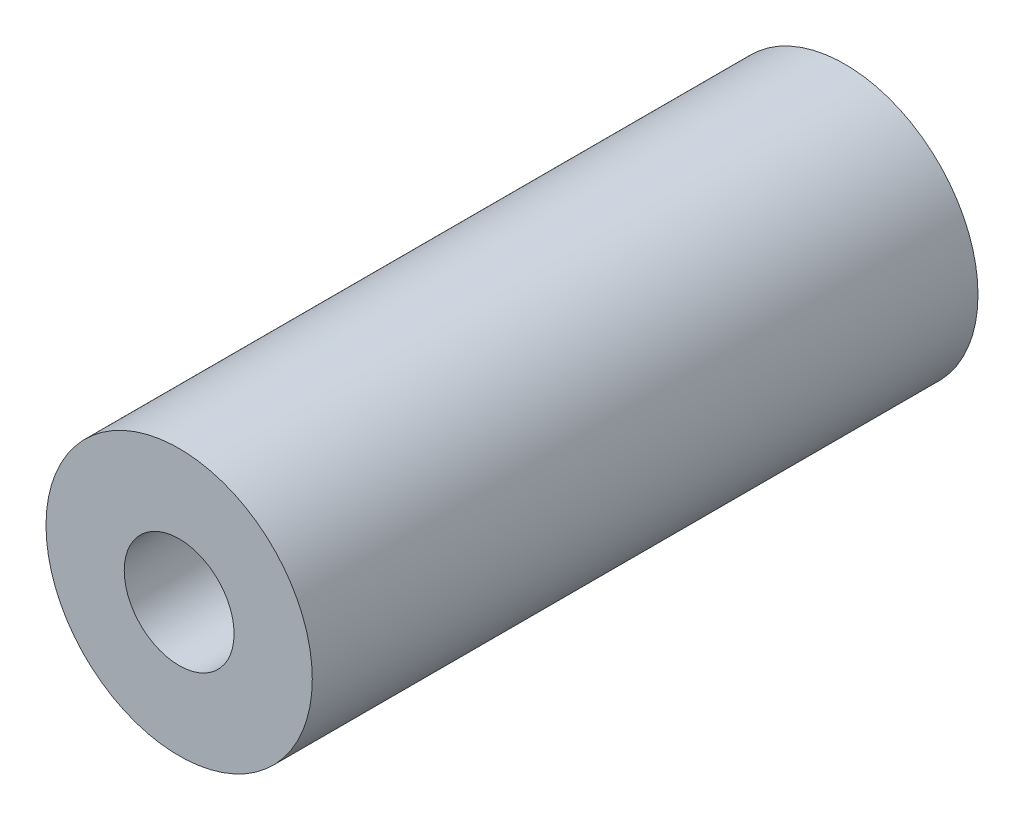
ISO-10303-21;
HEADER;
FILE_DESCRIPTION(('STEP AP214'),'2;1');
FILE_NAME('part.step','',(''),(''),'','','');
FILE_SCHEMA(('AUTOMOTIVE_DESIGN { 1 0 10303 214 1 1 1 1 }'));
ENDSEC;
DATA;
#1=APPLICATION_CONTEXT('core data for automotive mechanical design processes');
#2=APPLICATION_PROTOCOL_DEFINITION('international standard','automotive_design',2000,#1);
#3=PRODUCT_CONTEXT('',#1,'mechanical');
#4=PRODUCT('Part','Part','',(#3));
#5=PRODUCT_RELATED_PRODUCT_CATEGORY('part','',(#4));
#6=PRODUCT_DEFINITION_FORMATION('','',#4);
#7=PRODUCT_DEFINITION_CONTEXT('part definition',#1,'design');
#8=PRODUCT_DEFINITION('design','',#6,#7);
#9=PRODUCT_DEFINITION_SHAPE('','',#8);
#10=(LENGTH_UNIT() NAMED_UNIT(*) SI_UNIT(.MILLI.,.METRE.));
#11=(NAMED_UNIT(*) PLANE_ANGLE_UNIT() SI_UNIT($,.RADIAN.));
#12=(NAMED_UNIT(*) SI_UNIT($,.STERADIAN.) SOLID_ANGLE_UNIT());
#13=UNCERTAINTY_MEASURE_WITH_UNIT(LENGTH_MEASURE(1.E-05),#10,'distance_accuracy_value','');
#14=(GEOMETRIC_REPRESENTATION_CONTEXT(3) GLOBAL_UNCERTAINTY_ASSIGNED_CONTEXT((#13)) GLOBAL_UNIT_ASSIGNED_CONTEXT((#10,
#11,#12)) REPRESENTATION_CONTEXT('',''));
#15=CARTESIAN_POINT('',(0.,0.,0.));
#16=DIRECTION('',(0.,0.,1.));
#17=DIRECTION('',(1.,0.,0.));
#18=AXIS2_PLACEMENT_3D('',#15,#16,#17);
#19=CARTESIAN_POINT('',(0.,0.,10.));
#20=DIRECTION('',(0.,0.,-1.));
#21=DIRECTION('',(-1.,0.,0.));
#22=AXIS2_PLACEMENT_3D('',#19,#20,#21);
#23=CYLINDRICAL_SURFACE('',#22,4.);
#24=CARTESIAN_POINT('',(0.,0.,10.));
#25=DIRECTION('',(0.,0.,1.));
#26=DIRECTION('',(1.,0.,0.));
#27=AXIS2_PLACEMENT_3D('',#24,#25,#26);
#28=CIRCLE('',#27,4.);
#29=CARTESIAN_POINT('',(4.,0.,10.));
#30=VERTEX_POINT('',#29);
#31=EDGE_CURVE('E10',#30,#30,#28,.T.);
#32=ORIENTED_EDGE('',*,*,#31,.F.);
#33=EDGE_LOOP('',(#32));
#34=FACE_BOUND('',#33,.T.);
#35=CARTESIAN_POINT('',(0.,0.,-10.));
#36=DIRECTION('',(0.,0.,1.));
#37=DIRECTION('',(1.,0.,0.));
#38=AXIS2_PLACEMENT_3D('',#35,#36,#37);
#39=CIRCLE('',#38,4.);
#40=CARTESIAN_POINT('',(4.,0.,-10.));
#41=VERTEX_POINT('',#40);
#42=EDGE_CURVE('E38',#41,#41,#39,.T.);
#43=ORIENTED_EDGE('',*,*,#42,.T.);
#44=EDGE_LOOP('',(#43));
#45=FACE_BOUND('',#44,.T.);
#46=ADVANCED_FACE('F35',(#34,#45),#23,.T.);
#47=CARTESIAN_POINT('',(0.,0.,10.));
#48=DIRECTION('',(0.,0.,1.));
#49=DIRECTION('',(1.,0.,0.));
#50=AXIS2_PLACEMENT_3D('',#47,#48,#49);
#51=PLANE('',#50);
#52=CARTESIAN_POINT('',(0.,0.,10.));
#53=DIRECTION('',(0.,0.,1.));
#54=DIRECTION('',(1.,0.,0.));
#55=AXIS2_PLACEMENT_3D('',#52,#53,#54);
#56=CIRCLE('',#55,1.65);
#57=CARTESIAN_POINT('',(1.65,0.,10.));
#58=VERTEX_POINT('',#57);
#59=EDGE_CURVE('E49',#58,#58,#56,.T.);
#60=ORIENTED_EDGE('',*,*,#59,.F.);
#61=EDGE_LOOP('',(#60));
#62=FACE_BOUND('',#61,.T.);
#63=ORIENTED_EDGE('',*,*,#31,.T.);
#64=EDGE_LOOP('',(#63));
#65=FACE_BOUND('',#64,.T.);
#66=ADVANCED_FACE('F55',(#62,#65),#51,.T.);
#67=CARTESIAN_POINT('',(0.,0.,-10.));
#68=DIRECTION('',(0.,0.,1.));
#69=DIRECTION('',(1.,0.,0.));
#70=AXIS2_PLACEMENT_3D('',#67,#68,#69);
#71=PLANE('',#70);
#72=CARTESIAN_POINT('',(0.,0.,-10.));
#73=DIRECTION('',(0.,0.,-1.));
#74=DIRECTION('',(-1.,0.,0.));
#75=AXIS2_PLACEMENT_3D('',#72,#73,#74);
#76=CIRCLE('',#75,1.65);
#77=CARTESIAN_POINT('',(-1.65,0.,-10.));
#78=VERTEX_POINT('',#77);
#79=EDGE_CURVE('E45',#78,#78,#76,.T.);
#80=ORIENTED_EDGE('',*,*,#79,.F.);
#81=EDGE_LOOP('',(#80));
#82=FACE_BOUND('',#81,.T.);
#83=ORIENTED_EDGE('',*,*,#42,.F.);
#84=EDGE_LOOP('',(#83));
#85=FACE_BOUND('',#84,.T.);
#86=ADVANCED_FACE('F57',(#82,#85),#71,.F.);
#87=CARTESIAN_POINT('',(0.,0.,-10.));
#88=DIRECTION('',(0.,0.,-1.));
#89=DIRECTION('',(-1.,0.,0.));
#90=AXIS2_PLACEMENT_3D('',#87,#88,#89);
#91=CYLINDRICAL_SURFACE('',#90,1.65);
#92=ORIENTED_EDGE('',*,*,#79,.T.);
#93=EDGE_LOOP('',(#92));
#94=FACE_BOUND('',#93,.T.);
#95=ORIENTED_EDGE('',*,*,#59,.T.);
#96=EDGE_LOOP('',(#95));
#97=FACE_BOUND('',#96,.T.);
#98=ADVANCED_FACE('F53',(#94,#97),#91,.F.);
#99=CLOSED_SHELL('',(#46,#66,#86,#98));
#100=MANIFOLD_SOLID_BREP('B2',#99);
#101=ADVANCED_BREP_SHAPE_REPRESENTATION('',(#18,#100),#14);
#102=SHAPE_DEFINITION_REPRESENTATION(#9,#101);
ENDSEC;
END-ISO-10303-21;
